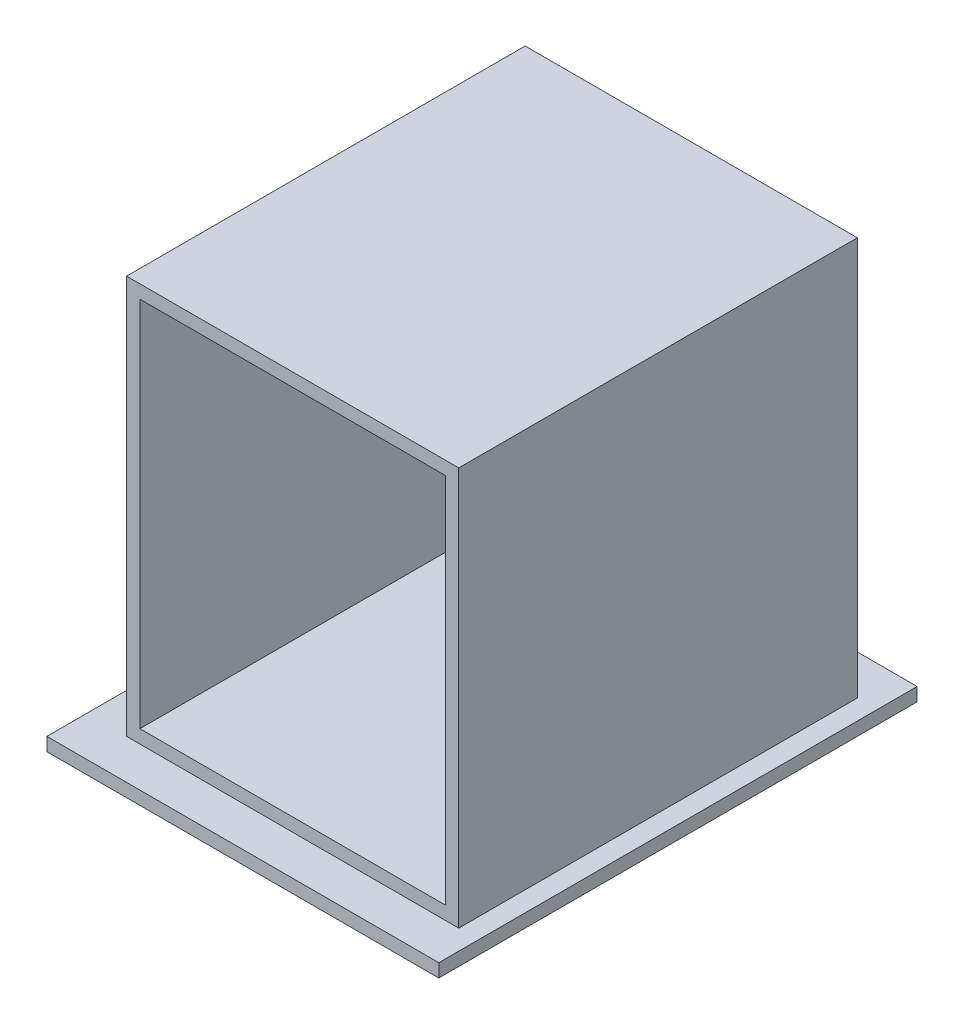
ISO-10303-21;
HEADER;
FILE_DESCRIPTION(('STEP AP214'),'2;1');
FILE_NAME('part.step','',(''),(''),'','','');
FILE_SCHEMA(('AUTOMOTIVE_DESIGN { 1 0 10303 214 1 1 1 1 }'));
ENDSEC;
DATA;
#1=APPLICATION_CONTEXT('core data for automotive mechanical design processes');
#2=APPLICATION_PROTOCOL_DEFINITION('international standard','automotive_design',2000,#1);
#3=PRODUCT_CONTEXT('',#1,'mechanical');
#4=PRODUCT('Part','Part','',(#3));
#5=PRODUCT_RELATED_PRODUCT_CATEGORY('part','',(#4));
#6=PRODUCT_DEFINITION_FORMATION('','',#4);
#7=PRODUCT_DEFINITION_CONTEXT('part definition',#1,'design');
#8=PRODUCT_DEFINITION('design','',#6,#7);
#9=PRODUCT_DEFINITION_SHAPE('','',#8);
#10=(LENGTH_UNIT() NAMED_UNIT(*) SI_UNIT(.MILLI.,.METRE.));
#11=(NAMED_UNIT(*) PLANE_ANGLE_UNIT() SI_UNIT($,.RADIAN.));
#12=(NAMED_UNIT(*) SI_UNIT($,.STERADIAN.) SOLID_ANGLE_UNIT());
#13=UNCERTAINTY_MEASURE_WITH_UNIT(LENGTH_MEASURE(1.E-05),#10,'distance_accuracy_value','');
#14=(GEOMETRIC_REPRESENTATION_CONTEXT(3) GLOBAL_UNCERTAINTY_ASSIGNED_CONTEXT((#13)) GLOBAL_UNIT_ASSIGNED_CONTEXT((#10,
#11,#12)) REPRESENTATION_CONTEXT('',''));
#15=CARTESIAN_POINT('',(0.,0.,0.));
#16=DIRECTION('',(0.,0.,1.));
#17=DIRECTION('',(1.,0.,0.));
#18=AXIS2_PLACEMENT_3D('',#15,#16,#17);
#19=CARTESIAN_POINT('',(0.,0.,300.));
#20=DIRECTION('',(1.,0.,0.));
#21=DIRECTION('',(0.,0.,-1.));
#22=AXIS2_PLACEMENT_3D('',#19,#20,#21);
#23=PLANE('',#22);
#24=DIRECTION('',(0.,-1.,0.));
#25=VECTOR('',#24,1.);
#26=CARTESIAN_POINT('',(0.,0.,0.));
#27=LINE('',#26,#25);
#28=CARTESIAN_POINT('',(0.,300.,0.));
#29=VERTEX_POINT('',#28);
#30=CARTESIAN_POINT('',(0.,0.,0.));
#31=VERTEX_POINT('',#30);
#32=EDGE_CURVE('E239',#29,#31,#27,.T.);
#33=ORIENTED_EDGE('',*,*,#32,.T.);
#34=DIRECTION('',(0.,0.,-1.));
#35=VECTOR('',#34,1.);
#36=CARTESIAN_POINT('',(0.,0.,300.));
#37=LINE('',#36,#35);
#38=CARTESIAN_POINT('',(0.,0.,300.));
#39=VERTEX_POINT('',#38);
#40=EDGE_CURVE('E11',#39,#31,#37,.T.);
#41=ORIENTED_EDGE('',*,*,#40,.F.);
#42=DIRECTION('',(0.,-1.,0.));
#43=VECTOR('',#42,1.);
#44=CARTESIAN_POINT('',(0.,0.,300.));
#45=LINE('',#44,#43);
#46=CARTESIAN_POINT('',(0.,300.,300.));
#47=VERTEX_POINT('',#46);
#48=EDGE_CURVE('E245',#47,#39,#45,.T.);
#49=ORIENTED_EDGE('',*,*,#48,.F.);
#50=DIRECTION('',(0.,0.,-1.));
#51=VECTOR('',#50,1.);
#52=CARTESIAN_POINT('',(0.,300.,300.));
#53=LINE('',#52,#51);
#54=EDGE_CURVE('E254',#47,#29,#53,.T.);
#55=ORIENTED_EDGE('',*,*,#54,.T.);
#56=EDGE_LOOP('',(#33,#41,#49,#55));
#57=FACE_BOUND('',#56,.T.);
#58=ADVANCED_FACE('F35',(#57),#23,.F.);
#59=CARTESIAN_POINT('',(250.,0.,300.));
#60=DIRECTION('',(-1.,0.,0.));
#61=DIRECTION('',(0.,-1.,0.));
#62=AXIS2_PLACEMENT_3D('',#59,#60,#61);
#63=PLANE('',#62);
#64=DIRECTION('',(0.,1.,0.));
#65=VECTOR('',#64,1.);
#66=CARTESIAN_POINT('',(250.,0.,0.));
#67=LINE('',#66,#65);
#68=CARTESIAN_POINT('',(250.,0.,0.));
#69=VERTEX_POINT('',#68);
#70=CARTESIAN_POINT('',(250.,300.,0.));
#71=VERTEX_POINT('',#70);
#72=EDGE_CURVE('E259',#69,#71,#67,.T.);
#73=ORIENTED_EDGE('',*,*,#72,.T.);
#74=DIRECTION('',(0.,0.,-1.));
#75=VECTOR('',#74,1.);
#76=CARTESIAN_POINT('',(250.,300.,300.));
#77=LINE('',#76,#75);
#78=CARTESIAN_POINT('',(250.,300.,300.));
#79=VERTEX_POINT('',#78);
#80=EDGE_CURVE('E264',#79,#71,#77,.T.);
#81=ORIENTED_EDGE('',*,*,#80,.F.);
#82=DIRECTION('',(0.,1.,0.));
#83=VECTOR('',#82,1.);
#84=CARTESIAN_POINT('',(250.,0.,300.));
#85=LINE('',#84,#83);
#86=CARTESIAN_POINT('',(250.,0.,300.));
#87=VERTEX_POINT('',#86);
#88=EDGE_CURVE('E250',#87,#79,#85,.T.);
#89=ORIENTED_EDGE('',*,*,#88,.F.);
#90=DIRECTION('',(0.,0.,-1.));
#91=VECTOR('',#90,1.);
#92=CARTESIAN_POINT('',(250.,0.,300.));
#93=LINE('',#92,#91);
#94=EDGE_CURVE('E42',#87,#69,#93,.T.);
#95=ORIENTED_EDGE('',*,*,#94,.T.);
#96=EDGE_LOOP('',(#73,#81,#89,#95));
#97=FACE_BOUND('',#96,.T.);
#98=ADVANCED_FACE('F270',(#97),#63,.F.);
#99=CARTESIAN_POINT('',(0.,300.,300.));
#100=DIRECTION('',(0.,-1.,0.));
#101=DIRECTION('',(0.,0.,-1.));
#102=AXIS2_PLACEMENT_3D('',#99,#100,#101);
#103=PLANE('',#102);
#104=DIRECTION('',(-1.,0.,0.));
#105=VECTOR('',#104,1.);
#106=CARTESIAN_POINT('',(0.,300.,0.));
#107=LINE('',#106,#105);
#108=EDGE_CURVE('E248',#71,#29,#107,.T.);
#109=ORIENTED_EDGE('',*,*,#108,.T.);
#110=ORIENTED_EDGE('',*,*,#54,.F.);
#111=DIRECTION('',(-1.,0.,0.));
#112=VECTOR('',#111,1.);
#113=CARTESIAN_POINT('',(0.,300.,300.));
#114=LINE('',#113,#112);
#115=EDGE_CURVE('E252',#79,#47,#114,.T.);
#116=ORIENTED_EDGE('',*,*,#115,.F.);
#117=ORIENTED_EDGE('',*,*,#80,.T.);
#118=EDGE_LOOP('',(#109,#110,#116,#117));
#119=FACE_BOUND('',#118,.T.);
#120=ADVANCED_FACE('F286',(#119),#103,.F.);
#121=CARTESIAN_POINT('',(0.,0.,300.));
#122=DIRECTION('',(0.,0.,-1.));
#123=DIRECTION('',(-1.,0.,0.));
#124=AXIS2_PLACEMENT_3D('',#121,#122,#123);
#125=PLANE('',#124);
#126=DIRECTION('',(1.,0.,0.));
#127=VECTOR('',#126,1.);
#128=CARTESIAN_POINT('',(10.,10.,300.));
#129=LINE('',#128,#127);
#130=CARTESIAN_POINT('',(10.,10.,300.));
#131=VERTEX_POINT('',#130);
#132=CARTESIAN_POINT('',(240.,10.,300.));
#133=VERTEX_POINT('',#132);
#134=EDGE_CURVE('E229',#131,#133,#129,.T.);
#135=ORIENTED_EDGE('',*,*,#134,.F.);
#136=DIRECTION('',(0.,-1.,0.));
#137=VECTOR('',#136,1.);
#138=CARTESIAN_POINT('',(10.,10.,300.));
#139=LINE('',#138,#137);
#140=CARTESIAN_POINT('',(10.,290.,300.));
#141=VERTEX_POINT('',#140);
#142=EDGE_CURVE('E57',#141,#131,#139,.T.);
#143=ORIENTED_EDGE('',*,*,#142,.F.);
#144=DIRECTION('',(-1.,0.,0.));
#145=VECTOR('',#144,1.);
#146=CARTESIAN_POINT('',(10.,290.,300.));
#147=LINE('',#146,#145);
#148=CARTESIAN_POINT('',(240.,290.,300.));
#149=VERTEX_POINT('',#148);
#150=EDGE_CURVE('E218',#149,#141,#147,.T.);
#151=ORIENTED_EDGE('',*,*,#150,.F.);
#152=DIRECTION('',(0.,1.,0.));
#153=VECTOR('',#152,1.);
#154=CARTESIAN_POINT('',(240.,10.,300.));
#155=LINE('',#154,#153);
#156=EDGE_CURVE('E232',#133,#149,#155,.T.);
#157=ORIENTED_EDGE('',*,*,#156,.F.);
#158=EDGE_LOOP('',(#135,#143,#151,#157));
#159=FACE_BOUND('',#158,.T.);
#160=ORIENTED_EDGE('',*,*,#48,.T.);
#161=DIRECTION('',(1.,0.,0.));
#162=VECTOR('',#161,1.);
#163=CARTESIAN_POINT('',(0.,0.,300.));
#164=LINE('',#163,#162);
#165=EDGE_CURVE('E247',#39,#87,#164,.T.);
#166=ORIENTED_EDGE('',*,*,#165,.T.);
#167=ORIENTED_EDGE('',*,*,#88,.T.);
#168=ORIENTED_EDGE('',*,*,#115,.T.);
#169=EDGE_LOOP('',(#160,#166,#167,#168));
#170=FACE_BOUND('',#169,.T.);
#171=ADVANCED_FACE('F288',(#159,#170),#125,.F.);
#172=CARTESIAN_POINT('',(0.,0.,0.));
#173=DIRECTION('',(0.,0.,-1.));
#174=DIRECTION('',(-1.,0.,0.));
#175=AXIS2_PLACEMENT_3D('',#172,#173,#174);
#176=PLANE('',#175);
#177=ORIENTED_EDGE('',*,*,#32,.F.);
#178=ORIENTED_EDGE('',*,*,#108,.F.);
#179=ORIENTED_EDGE('',*,*,#72,.F.);
#180=DIRECTION('',(1.,0.,0.));
#181=VECTOR('',#180,1.);
#182=CARTESIAN_POINT('',(0.,0.,0.));
#183=LINE('',#182,#181);
#184=EDGE_CURVE('E256',#31,#69,#183,.T.);
#185=ORIENTED_EDGE('',*,*,#184,.F.);
#186=EDGE_LOOP('',(#177,#178,#179,#185));
#187=FACE_BOUND('',#186,.T.);
#188=ADVANCED_FACE('F278',(#187),#176,.T.);
#189=CARTESIAN_POINT('',(10.,10.,10.));
#190=DIRECTION('',(-1.,0.,0.));
#191=DIRECTION('',(0.,-1.,0.));
#192=AXIS2_PLACEMENT_3D('',#189,#190,#191);
#193=PLANE('',#192);
#194=ORIENTED_EDGE('',*,*,#142,.T.);
#195=DIRECTION('',(0.,0.,1.));
#196=VECTOR('',#195,1.);
#197=CARTESIAN_POINT('',(10.,10.,10.));
#198=LINE('',#197,#196);
#199=CARTESIAN_POINT('',(10.,10.,10.));
#200=VERTEX_POINT('',#199);
#201=EDGE_CURVE('E227',#200,#131,#198,.T.);
#202=ORIENTED_EDGE('',*,*,#201,.F.);
#203=DIRECTION('',(0.,-1.,0.));
#204=VECTOR('',#203,1.);
#205=CARTESIAN_POINT('',(10.,10.,10.));
#206=LINE('',#205,#204);
#207=CARTESIAN_POINT('',(10.,290.,10.));
#208=VERTEX_POINT('',#207);
#209=EDGE_CURVE('E214',#208,#200,#206,.T.);
#210=ORIENTED_EDGE('',*,*,#209,.F.);
#211=DIRECTION('',(0.,0.,1.));
#212=VECTOR('',#211,1.);
#213=CARTESIAN_POINT('',(10.,290.,10.));
#214=LINE('',#213,#212);
#215=EDGE_CURVE('E237',#208,#141,#214,.T.);
#216=ORIENTED_EDGE('',*,*,#215,.T.);
#217=EDGE_LOOP('',(#194,#202,#210,#216));
#218=FACE_BOUND('',#217,.T.);
#219=ADVANCED_FACE('F296',(#218),#193,.F.);
#220=CARTESIAN_POINT('',(10.,290.,10.));
#221=DIRECTION('',(0.,1.,0.));
#222=DIRECTION('',(0.,0.,1.));
#223=AXIS2_PLACEMENT_3D('',#220,#221,#222);
#224=PLANE('',#223);
#225=ORIENTED_EDGE('',*,*,#150,.T.);
#226=ORIENTED_EDGE('',*,*,#215,.F.);
#227=DIRECTION('',(-1.,0.,0.));
#228=VECTOR('',#227,1.);
#229=CARTESIAN_POINT('',(10.,290.,10.));
#230=LINE('',#229,#228);
#231=CARTESIAN_POINT('',(240.,290.,10.));
#232=VERTEX_POINT('',#231);
#233=EDGE_CURVE('E224',#232,#208,#230,.T.);
#234=ORIENTED_EDGE('',*,*,#233,.F.);
#235=DIRECTION('',(0.,0.,1.));
#236=VECTOR('',#235,1.);
#237=CARTESIAN_POINT('',(240.,290.,10.));
#238=LINE('',#237,#236);
#239=EDGE_CURVE('E240',#232,#149,#238,.T.);
#240=ORIENTED_EDGE('',*,*,#239,.T.);
#241=EDGE_LOOP('',(#225,#226,#234,#240));
#242=FACE_BOUND('',#241,.T.);
#243=ADVANCED_FACE('F321',(#242),#224,.F.);
#244=CARTESIAN_POINT('',(240.,10.,10.));
#245=DIRECTION('',(1.,0.,0.));
#246=DIRECTION('',(0.,0.,-1.));
#247=AXIS2_PLACEMENT_3D('',#244,#245,#246);
#248=PLANE('',#247);
#249=ORIENTED_EDGE('',*,*,#156,.T.);
#250=ORIENTED_EDGE('',*,*,#239,.F.);
#251=DIRECTION('',(0.,1.,0.));
#252=VECTOR('',#251,1.);
#253=CARTESIAN_POINT('',(240.,10.,10.));
#254=LINE('',#253,#252);
#255=CARTESIAN_POINT('',(240.,10.,10.));
#256=VERTEX_POINT('',#255);
#257=EDGE_CURVE('E221',#256,#232,#254,.T.);
#258=ORIENTED_EDGE('',*,*,#257,.F.);
#259=DIRECTION('',(0.,0.,1.));
#260=VECTOR('',#259,1.);
#261=CARTESIAN_POINT('',(240.,10.,10.));
#262=LINE('',#261,#260);
#263=EDGE_CURVE('E242',#256,#133,#262,.T.);
#264=ORIENTED_EDGE('',*,*,#263,.T.);
#265=EDGE_LOOP('',(#249,#250,#258,#264));
#266=FACE_BOUND('',#265,.T.);
#267=ADVANCED_FACE('F330',(#266),#248,.F.);
#268=CARTESIAN_POINT('',(10.,10.,10.));
#269=DIRECTION('',(0.,-1.,0.));
#270=DIRECTION('',(0.,0.,-1.));
#271=AXIS2_PLACEMENT_3D('',#268,#269,#270);
#272=PLANE('',#271);
#273=ORIENTED_EDGE('',*,*,#134,.T.);
#274=ORIENTED_EDGE('',*,*,#263,.F.);
#275=DIRECTION('',(1.,0.,0.));
#276=VECTOR('',#275,1.);
#277=CARTESIAN_POINT('',(10.,10.,10.));
#278=LINE('',#277,#276);
#279=EDGE_CURVE('E217',#200,#256,#278,.T.);
#280=ORIENTED_EDGE('',*,*,#279,.F.);
#281=ORIENTED_EDGE('',*,*,#201,.T.);
#282=EDGE_LOOP('',(#273,#274,#280,#281));
#283=FACE_BOUND('',#282,.T.);
#284=ADVANCED_FACE('F340',(#283),#272,.F.);
#285=CARTESIAN_POINT('',(0.,0.,10.));
#286=DIRECTION('',(0.,0.,-1.));
#287=DIRECTION('',(-1.,0.,0.));
#288=AXIS2_PLACEMENT_3D('',#285,#286,#287);
#289=PLANE('',#288);
#290=ORIENTED_EDGE('',*,*,#209,.T.);
#291=ORIENTED_EDGE('',*,*,#279,.T.);
#292=ORIENTED_EDGE('',*,*,#257,.T.);
#293=ORIENTED_EDGE('',*,*,#233,.T.);
#294=EDGE_LOOP('',(#290,#291,#292,#293));
#295=FACE_BOUND('',#294,.T.);
#296=ADVANCED_FACE('F350',(#295),#289,.F.);
#297=CARTESIAN_POINT('',(0.,0.,0.));
#298=DIRECTION('',(0.,-1.,0.));
#299=DIRECTION('',(0.,0.,-1.));
#300=AXIS2_PLACEMENT_3D('',#297,#298,#299);
#301=PLANE('',#300);
#302=DIRECTION('',(0.,0.,-1.));
#303=VECTOR('',#302,1.);
#304=CARTESIAN_POINT('',(-30.,0.,330.));
#305=LINE('',#304,#303);
#306=CARTESIAN_POINT('',(-30.,0.,330.));
#307=VERTEX_POINT('',#306);
#308=CARTESIAN_POINT('',(-30.,0.,-30.));
#309=VERTEX_POINT('',#308);
#310=EDGE_CURVE('E181',#307,#309,#305,.T.);
#311=ORIENTED_EDGE('',*,*,#310,.F.);
#312=DIRECTION('',(-1.,0.,0.));
#313=VECTOR('',#312,1.);
#314=CARTESIAN_POINT('',(-30.,0.,330.));
#315=LINE('',#314,#313);
#316=CARTESIAN_POINT('',(265.,0.,330.));
#317=VERTEX_POINT('',#316);
#318=EDGE_CURVE('E189',#317,#307,#315,.T.);
#319=ORIENTED_EDGE('',*,*,#318,.F.);
#320=DIRECTION('',(0.,0.,1.));
#321=VECTOR('',#320,1.);
#322=CARTESIAN_POINT('',(265.,0.,330.));
#323=LINE('',#322,#321);
#324=CARTESIAN_POINT('',(265.,0.,-30.));
#325=VERTEX_POINT('',#324);
#326=EDGE_CURVE('E200',#325,#317,#323,.T.);
#327=ORIENTED_EDGE('',*,*,#326,.F.);
#328=DIRECTION('',(1.,0.,0.));
#329=VECTOR('',#328,1.);
#330=CARTESIAN_POINT('',(-30.,0.,-30.));
#331=LINE('',#330,#329);
#332=EDGE_CURVE('E198',#309,#325,#331,.T.);
#333=ORIENTED_EDGE('',*,*,#332,.F.);
#334=EDGE_LOOP('',(#311,#319,#327,#333));
#335=FACE_BOUND('',#334,.T.);
#336=ORIENTED_EDGE('',*,*,#40,.T.);
#337=ORIENTED_EDGE('',*,*,#184,.T.);
#338=ORIENTED_EDGE('',*,*,#94,.F.);
#339=ORIENTED_EDGE('',*,*,#165,.F.);
#340=EDGE_LOOP('',(#336,#337,#338,#339));
#341=FACE_BOUND('',#340,.T.);
#342=ADVANCED_FACE('F279',(#335,#341),#301,.F.);
#343=CARTESIAN_POINT('',(-30.,-10.,330.));
#344=DIRECTION('',(1.,0.,0.));
#345=DIRECTION('',(0.,0.,-1.));
#346=AXIS2_PLACEMENT_3D('',#343,#344,#345);
#347=PLANE('',#346);
#348=ORIENTED_EDGE('',*,*,#310,.T.);
#349=DIRECTION('',(0.,1.,0.));
#350=VECTOR('',#349,1.);
#351=CARTESIAN_POINT('',(-30.,-10.,-30.));
#352=LINE('',#351,#350);
#353=CARTESIAN_POINT('',(-30.,-10.,-30.));
#354=VERTEX_POINT('',#353);
#355=EDGE_CURVE('E211',#354,#309,#352,.T.);
#356=ORIENTED_EDGE('',*,*,#355,.F.);
#357=DIRECTION('',(0.,0.,-1.));
#358=VECTOR('',#357,1.);
#359=CARTESIAN_POINT('',(-30.,-10.,330.));
#360=LINE('',#359,#358);
#361=CARTESIAN_POINT('',(-30.,-10.,330.));
#362=VERTEX_POINT('',#361);
#363=EDGE_CURVE('E185',#362,#354,#360,.T.);
#364=ORIENTED_EDGE('',*,*,#363,.F.);
#365=DIRECTION('',(0.,1.,0.));
#366=VECTOR('',#365,1.);
#367=CARTESIAN_POINT('',(-30.,-10.,330.));
#368=LINE('',#367,#366);
#369=EDGE_CURVE('E195',#362,#307,#368,.T.);
#370=ORIENTED_EDGE('',*,*,#369,.T.);
#371=EDGE_LOOP('',(#348,#356,#364,#370));
#372=FACE_BOUND('',#371,.T.);
#373=ADVANCED_FACE('F375',(#372),#347,.F.);
#374=CARTESIAN_POINT('',(-30.,-10.,-30.));
#375=DIRECTION('',(0.,0.,1.));
#376=DIRECTION('',(1.,0.,0.));
#377=AXIS2_PLACEMENT_3D('',#374,#375,#376);
#378=PLANE('',#377);
#379=ORIENTED_EDGE('',*,*,#332,.T.);
#380=DIRECTION('',(0.,1.,0.));
#381=VECTOR('',#380,1.);
#382=CARTESIAN_POINT('',(265.,-10.,-30.));
#383=LINE('',#382,#381);
#384=CARTESIAN_POINT('',(265.,-10.,-30.));
#385=VERTEX_POINT('',#384);
#386=EDGE_CURVE('E208',#385,#325,#383,.T.);
#387=ORIENTED_EDGE('',*,*,#386,.F.);
#388=DIRECTION('',(1.,0.,0.));
#389=VECTOR('',#388,1.);
#390=CARTESIAN_POINT('',(-30.,-10.,-30.));
#391=LINE('',#390,#389);
#392=EDGE_CURVE('E188',#354,#385,#391,.T.);
#393=ORIENTED_EDGE('',*,*,#392,.F.);
#394=ORIENTED_EDGE('',*,*,#355,.T.);
#395=EDGE_LOOP('',(#379,#387,#393,#394));
#396=FACE_BOUND('',#395,.T.);
#397=ADVANCED_FACE('F383',(#396),#378,.F.);
#398=CARTESIAN_POINT('',(265.,-10.,330.));
#399=DIRECTION('',(-1.,0.,0.));
#400=DIRECTION('',(0.,0.,1.));
#401=AXIS2_PLACEMENT_3D('',#398,#399,#400);
#402=PLANE('',#401);
#403=ORIENTED_EDGE('',*,*,#326,.T.);
#404=DIRECTION('',(0.,1.,0.));
#405=VECTOR('',#404,1.);
#406=CARTESIAN_POINT('',(265.,-10.,330.));
#407=LINE('',#406,#405);
#408=CARTESIAN_POINT('',(265.,-10.,330.));
#409=VERTEX_POINT('',#408);
#410=EDGE_CURVE('E205',#409,#317,#407,.T.);
#411=ORIENTED_EDGE('',*,*,#410,.F.);
#412=DIRECTION('',(0.,0.,1.));
#413=VECTOR('',#412,1.);
#414=CARTESIAN_POINT('',(265.,-10.,330.));
#415=LINE('',#414,#413);
#416=EDGE_CURVE('E191',#385,#409,#415,.T.);
#417=ORIENTED_EDGE('',*,*,#416,.F.);
#418=ORIENTED_EDGE('',*,*,#386,.T.);
#419=EDGE_LOOP('',(#403,#411,#417,#418));
#420=FACE_BOUND('',#419,.T.);
#421=ADVANCED_FACE('F391',(#420),#402,.F.);
#422=CARTESIAN_POINT('',(-30.,-10.,330.));
#423=DIRECTION('',(0.,0.,-1.));
#424=DIRECTION('',(-1.,0.,0.));
#425=AXIS2_PLACEMENT_3D('',#422,#423,#424);
#426=PLANE('',#425);
#427=ORIENTED_EDGE('',*,*,#318,.T.);
#428=ORIENTED_EDGE('',*,*,#369,.F.);
#429=DIRECTION('',(-1.,0.,0.));
#430=VECTOR('',#429,1.);
#431=CARTESIAN_POINT('',(-30.,-10.,330.));
#432=LINE('',#431,#430);
#433=EDGE_CURVE('E193',#409,#362,#432,.T.);
#434=ORIENTED_EDGE('',*,*,#433,.F.);
#435=ORIENTED_EDGE('',*,*,#410,.T.);
#436=EDGE_LOOP('',(#427,#428,#434,#435));
#437=FACE_BOUND('',#436,.T.);
#438=ADVANCED_FACE('F399',(#437),#426,.F.);
#439=CARTESIAN_POINT('',(0.,-10.,0.));
#440=DIRECTION('',(0.,-1.,0.));
#441=DIRECTION('',(0.,0.,-1.));
#442=AXIS2_PLACEMENT_3D('',#439,#440,#441);
#443=PLANE('',#442);
#444=CARTESIAN_POINT('',(75.4108849380879,-10.,270.));
#445=DIRECTION('',(0.,-1.,0.));
#446=DIRECTION('',(0.,0.,-1.));
#447=AXIS2_PLACEMENT_3D('',#444,#445,#446);
#448=CIRCLE('',#447,14.2192956290244);
#449=CARTESIAN_POINT('',(75.4108849380879,-10.,284.219295629024));
#450=VERTEX_POINT('',#449);
#451=CARTESIAN_POINT('',(75.4108849380879,-10.,255.780704370976));
#452=VERTEX_POINT('',#451);
#453=EDGE_CURVE('E49',#450,#452,#448,.T.);
#454=ORIENTED_EDGE('',*,*,#453,.F.);
#455=DIRECTION('',(1.,0.,0.));
#456=VECTOR('',#455,1.);
#457=CARTESIAN_POINT('',(75.4108849380879,-10.,284.219295629024));
#458=LINE('',#457,#456);
#459=CARTESIAN_POINT('',(151.626309509659,-10.,284.219295629024));
#460=VERTEX_POINT('',#459);
#461=EDGE_CURVE('E166',#450,#460,#458,.T.);
#462=ORIENTED_EDGE('',*,*,#461,.T.);
#463=CARTESIAN_POINT('',(151.626309509659,-10.,270.));
#464=DIRECTION('',(0.,-1.,0.));
#465=DIRECTION('',(0.,0.,-1.));
#466=AXIS2_PLACEMENT_3D('',#463,#464,#465);
#467=CIRCLE('',#466,14.2192956290244);
#468=CARTESIAN_POINT('',(151.626309509659,-10.,255.780704370976));
#469=VERTEX_POINT('',#468);
#470=EDGE_CURVE('E169',#469,#460,#467,.T.);
#471=ORIENTED_EDGE('',*,*,#470,.F.);
#472=DIRECTION('',(1.,0.,0.));
#473=VECTOR('',#472,1.);
#474=CARTESIAN_POINT('',(75.4108849380879,-10.,255.780704370976));
#475=LINE('',#474,#473);
#476=EDGE_CURVE('E175',#452,#469,#475,.T.);
#477=ORIENTED_EDGE('',*,*,#476,.F.);
#478=EDGE_LOOP('',(#454,#462,#471,#477));
#479=FACE_BOUND('',#478,.T.);
#480=ORIENTED_EDGE('',*,*,#363,.T.);
#481=ORIENTED_EDGE('',*,*,#392,.T.);
#482=ORIENTED_EDGE('',*,*,#416,.T.);
#483=ORIENTED_EDGE('',*,*,#433,.T.);
#484=EDGE_LOOP('',(#480,#481,#482,#483));
#485=FACE_BOUND('',#484,.T.);
#486=ADVANCED_FACE('F407',(#479,#485),#443,.T.);
#487=CARTESIAN_POINT('',(75.4108849380879,5.,270.));
#488=DIRECTION('',(0.,-1.,0.));
#489=DIRECTION('',(0.,0.,-1.));
#490=AXIS2_PLACEMENT_3D('',#487,#488,#489);
#491=CYLINDRICAL_SURFACE('',#490,14.2192956290244);
#492=ORIENTED_EDGE('',*,*,#453,.T.);
#493=DIRECTION('',(0.,-1.,0.));
#494=VECTOR('',#493,1.);
#495=CARTESIAN_POINT('',(75.4108849380879,5.,255.780704370976));
#496=LINE('',#495,#494);
#497=CARTESIAN_POINT('',(75.4108849380879,5.,255.780704370976));
#498=VERTEX_POINT('',#497);
#499=EDGE_CURVE('E145',#498,#452,#496,.T.);
#500=ORIENTED_EDGE('',*,*,#499,.F.);
#501=CARTESIAN_POINT('',(75.4108849380879,5.,270.));
#502=DIRECTION('',(0.,-1.,0.));
#503=DIRECTION('',(0.,0.,-1.));
#504=AXIS2_PLACEMENT_3D('',#501,#502,#503);
#505=CIRCLE('',#504,14.2192956290244);
#506=CARTESIAN_POINT('',(75.4108849380879,5.,284.219295629024));
#507=VERTEX_POINT('',#506);
#508=EDGE_CURVE('E149',#507,#498,#505,.T.);
#509=ORIENTED_EDGE('',*,*,#508,.F.);
#510=DIRECTION('',(0.,-1.,0.));
#511=VECTOR('',#510,1.);
#512=CARTESIAN_POINT('',(75.4108849380879,5.,284.219295629024));
#513=LINE('',#512,#511);
#514=EDGE_CURVE('E179',#507,#450,#513,.T.);
#515=ORIENTED_EDGE('',*,*,#514,.T.);
#516=EDGE_LOOP('',(#492,#500,#509,#515));
#517=FACE_BOUND('',#516,.T.);
#518=ADVANCED_FACE('F147',(#517),#491,.F.);
#519=CARTESIAN_POINT('',(75.4108849380879,5.,284.219295629024));
#520=DIRECTION('',(0.,0.,-1.));
#521=DIRECTION('',(-1.,0.,0.));
#522=AXIS2_PLACEMENT_3D('',#519,#520,#521);
#523=PLANE('',#522);
#524=ORIENTED_EDGE('',*,*,#461,.F.);
#525=ORIENTED_EDGE('',*,*,#514,.F.);
#526=DIRECTION('',(1.,0.,0.));
#527=VECTOR('',#526,1.);
#528=CARTESIAN_POINT('',(75.4108849380879,5.,284.219295629024));
#529=LINE('',#528,#527);
#530=CARTESIAN_POINT('',(151.626309509659,5.,284.219295629024));
#531=VERTEX_POINT('',#530);
#532=EDGE_CURVE('E154',#507,#531,#529,.T.);
#533=ORIENTED_EDGE('',*,*,#532,.T.);
#534=DIRECTION('',(0.,-1.,0.));
#535=VECTOR('',#534,1.);
#536=CARTESIAN_POINT('',(151.626309509659,5.,284.219295629024));
#537=LINE('',#536,#535);
#538=EDGE_CURVE('E182',#531,#460,#537,.T.);
#539=ORIENTED_EDGE('',*,*,#538,.T.);
#540=EDGE_LOOP('',(#524,#525,#533,#539));
#541=FACE_BOUND('',#540,.T.);
#542=ADVANCED_FACE('F425',(#541),#523,.T.);
#543=CARTESIAN_POINT('',(151.626309509659,5.,270.));
#544=DIRECTION('',(0.,-1.,0.));
#545=DIRECTION('',(0.,0.,-1.));
#546=AXIS2_PLACEMENT_3D('',#543,#544,#545);
#547=CYLINDRICAL_SURFACE('',#546,14.2192956290244);
#548=ORIENTED_EDGE('',*,*,#470,.T.);
#549=ORIENTED_EDGE('',*,*,#538,.F.);
#550=CARTESIAN_POINT('',(151.626309509659,5.,270.));
#551=DIRECTION('',(0.,-1.,0.));
#552=DIRECTION('',(0.,0.,-1.));
#553=AXIS2_PLACEMENT_3D('',#550,#551,#552);
#554=CIRCLE('',#553,14.2192956290244);
#555=CARTESIAN_POINT('',(151.626309509659,5.,255.780704370976));
#556=VERTEX_POINT('',#555);
#557=EDGE_CURVE('E162',#556,#531,#554,.T.);
#558=ORIENTED_EDGE('',*,*,#557,.F.);
#559=DIRECTION('',(0.,-1.,0.));
#560=VECTOR('',#559,1.);
#561=CARTESIAN_POINT('',(151.626309509659,5.,255.780704370976));
#562=LINE('',#561,#560);
#563=EDGE_CURVE('E153',#556,#469,#562,.T.);
#564=ORIENTED_EDGE('',*,*,#563,.T.);
#565=EDGE_LOOP('',(#548,#549,#558,#564));
#566=FACE_BOUND('',#565,.T.);
#567=ADVANCED_FACE('F431',(#566),#547,.F.);
#568=CARTESIAN_POINT('',(75.4108849380879,5.,255.780704370976));
#569=DIRECTION('',(0.,0.,-1.));
#570=DIRECTION('',(-1.,0.,0.));
#571=AXIS2_PLACEMENT_3D('',#568,#569,#570);
#572=PLANE('',#571);
#573=ORIENTED_EDGE('',*,*,#476,.T.);
#574=ORIENTED_EDGE('',*,*,#563,.F.);
#575=DIRECTION('',(1.,0.,0.));
#576=VECTOR('',#575,1.);
#577=CARTESIAN_POINT('',(75.4108849380879,5.,255.780704370976));
#578=LINE('',#577,#576);
#579=EDGE_CURVE('E157',#498,#556,#578,.T.);
#580=ORIENTED_EDGE('',*,*,#579,.F.);
#581=ORIENTED_EDGE('',*,*,#499,.T.);
#582=EDGE_LOOP('',(#573,#574,#580,#581));
#583=FACE_BOUND('',#582,.T.);
#584=ADVANCED_FACE('F158',(#583),#572,.F.);
#585=CARTESIAN_POINT('',(75.4108849380879,5.,270.));
#586=DIRECTION('',(0.,-1.,0.));
#587=DIRECTION('',(0.,0.,-1.));
#588=AXIS2_PLACEMENT_3D('',#585,#586,#587);
#589=PLANE('',#588);
#590=ORIENTED_EDGE('',*,*,#508,.T.);
#591=ORIENTED_EDGE('',*,*,#579,.T.);
#592=ORIENTED_EDGE('',*,*,#557,.T.);
#593=ORIENTED_EDGE('',*,*,#532,.F.);
#594=EDGE_LOOP('',(#590,#591,#592,#593));
#595=FACE_BOUND('',#594,.T.);
#596=ADVANCED_FACE('F165',(#595),#589,.T.);
#597=CLOSED_SHELL('',(#58,#98,#120,#171,#188,#219,#243,#267,#284,#296,#342,#373,#397,#421,#438,
#486,#518,#542,#567,#584,#596));
#598=MANIFOLD_SOLID_BREP('B2',#597);
#599=ADVANCED_BREP_SHAPE_REPRESENTATION('',(#18,#598),#14);
#600=SHAPE_DEFINITION_REPRESENTATION(#9,#599);
ENDSEC;
END-ISO-10303-21;
